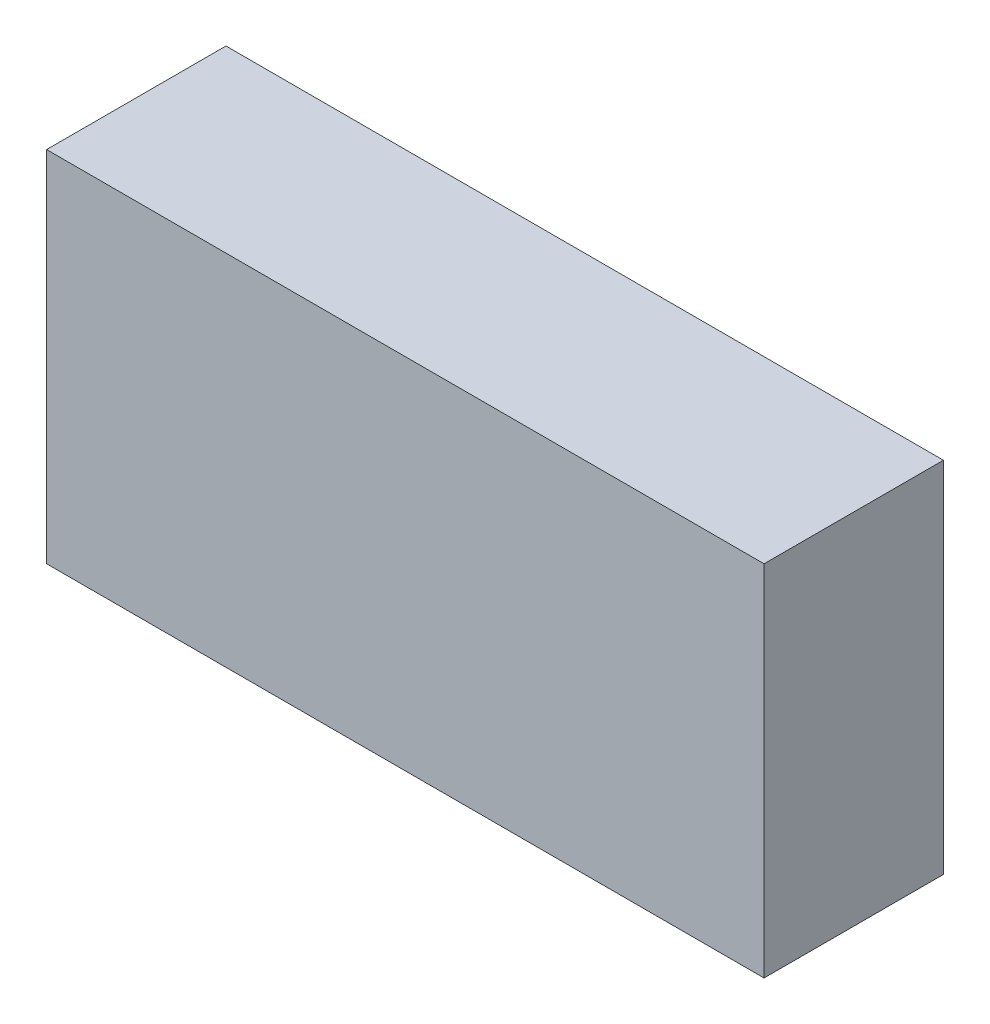
ISO-10303-21;
HEADER;
FILE_DESCRIPTION(('STEP AP214'),'2;1');
FILE_NAME('part.step','',(''),(''),'','','');
FILE_SCHEMA(('AUTOMOTIVE_DESIGN { 1 0 10303 214 1 1 1 1 }'));
ENDSEC;
DATA;
#1=APPLICATION_CONTEXT('core data for automotive mechanical design processes');
#2=APPLICATION_PROTOCOL_DEFINITION('international standard','automotive_design',2000,#1);
#3=PRODUCT_CONTEXT('',#1,'mechanical');
#4=PRODUCT('Part','Part','',(#3));
#5=PRODUCT_RELATED_PRODUCT_CATEGORY('part','',(#4));
#6=PRODUCT_DEFINITION_FORMATION('','',#4);
#7=PRODUCT_DEFINITION_CONTEXT('part definition',#1,'design');
#8=PRODUCT_DEFINITION('design','',#6,#7);
#9=PRODUCT_DEFINITION_SHAPE('','',#8);
#10=(LENGTH_UNIT() NAMED_UNIT(*) SI_UNIT(.MILLI.,.METRE.));
#11=(NAMED_UNIT(*) PLANE_ANGLE_UNIT() SI_UNIT($,.RADIAN.));
#12=(NAMED_UNIT(*) SI_UNIT($,.STERADIAN.) SOLID_ANGLE_UNIT());
#13=UNCERTAINTY_MEASURE_WITH_UNIT(LENGTH_MEASURE(1.E-05),#10,'distance_accuracy_value','');
#14=(GEOMETRIC_REPRESENTATION_CONTEXT(3) GLOBAL_UNCERTAINTY_ASSIGNED_CONTEXT((#13)) GLOBAL_UNIT_ASSIGNED_CONTEXT((#10,
#11,#12)) REPRESENTATION_CONTEXT('',''));
#15=CARTESIAN_POINT('',(0.,0.,0.));
#16=DIRECTION('',(0.,0.,1.));
#17=DIRECTION('',(1.,0.,0.));
#18=AXIS2_PLACEMENT_3D('',#15,#16,#17);
#19=CARTESIAN_POINT('',(0.80000094,-0.3999992,0.));
#20=DIRECTION('',(-1.,0.,0.));
#21=DIRECTION('',(0.,0.,1.));
#22=AXIS2_PLACEMENT_3D('',#19,#20,#21);
#23=PLANE('',#22);
#24=DIRECTION('',(0.,1.,0.));
#25=VECTOR('',#24,1.);
#26=CARTESIAN_POINT('',(0.80000094,-0.3999992,0.));
#27=LINE('',#26,#25);
#28=CARTESIAN_POINT('',(0.80000094,-0.3999992,0.));
#29=VERTEX_POINT('',#28);
#30=CARTESIAN_POINT('',(0.80000094,0.3999992,0.));
#31=VERTEX_POINT('',#30);
#32=EDGE_CURVE('E11',#29,#31,#27,.T.);
#33=ORIENTED_EDGE('',*,*,#32,.T.);
#34=DIRECTION('',(0.,0.,1.));
#35=VECTOR('',#34,1.);
#36=CARTESIAN_POINT('',(0.80000094,0.3999992,0.));
#37=LINE('',#36,#35);
#38=CARTESIAN_POINT('',(0.80000094,0.3999992,0.3999992));
#39=VERTEX_POINT('',#38);
#40=EDGE_CURVE('E27',#31,#39,#37,.T.);
#41=ORIENTED_EDGE('',*,*,#40,.T.);
#42=DIRECTION('',(0.,1.,0.));
#43=VECTOR('',#42,1.);
#44=CARTESIAN_POINT('',(0.80000094,-0.3999992,0.3999992));
#45=LINE('',#44,#43);
#46=CARTESIAN_POINT('',(0.80000094,-0.3999992,0.3999992));
#47=VERTEX_POINT('',#46);
#48=EDGE_CURVE('E50',#47,#39,#45,.T.);
#49=ORIENTED_EDGE('',*,*,#48,.F.);
#50=DIRECTION('',(0.,0.,1.));
#51=VECTOR('',#50,1.);
#52=CARTESIAN_POINT('',(0.80000094,-0.3999992,0.));
#53=LINE('',#52,#51);
#54=EDGE_CURVE('E55',#29,#47,#53,.T.);
#55=ORIENTED_EDGE('',*,*,#54,.F.);
#56=EDGE_LOOP('',(#33,#41,#49,#55));
#57=FACE_BOUND('',#56,.T.);
#58=ADVANCED_FACE('F17',(#57),#23,.F.);
#59=CARTESIAN_POINT('',(0.80000094,0.3999992,0.));
#60=DIRECTION('',(0.,-1.,0.));
#61=DIRECTION('',(0.,0.,-1.));
#62=AXIS2_PLACEMENT_3D('',#59,#60,#61);
#63=PLANE('',#62);
#64=DIRECTION('',(-1.,0.,0.));
#65=VECTOR('',#64,1.);
#66=CARTESIAN_POINT('',(0.80000094,0.3999992,0.));
#67=LINE('',#66,#65);
#68=CARTESIAN_POINT('',(-0.80000094,0.3999992,0.));
#69=VERTEX_POINT('',#68);
#70=EDGE_CURVE('E113',#31,#69,#67,.T.);
#71=ORIENTED_EDGE('',*,*,#70,.T.);
#72=DIRECTION('',(0.,0.,1.));
#73=VECTOR('',#72,1.);
#74=CARTESIAN_POINT('',(-0.80000094,0.3999992,0.));
#75=LINE('',#74,#73);
#76=CARTESIAN_POINT('',(-0.80000094,0.3999992,0.3999992));
#77=VERTEX_POINT('',#76);
#78=EDGE_CURVE('E68',#69,#77,#75,.T.);
#79=ORIENTED_EDGE('',*,*,#78,.T.);
#80=DIRECTION('',(-1.,0.,0.));
#81=VECTOR('',#80,1.);
#82=CARTESIAN_POINT('',(0.80000094,0.3999992,0.3999992));
#83=LINE('',#82,#81);
#84=EDGE_CURVE('E109',#39,#77,#83,.T.);
#85=ORIENTED_EDGE('',*,*,#84,.F.);
#86=ORIENTED_EDGE('',*,*,#40,.F.);
#87=EDGE_LOOP('',(#71,#79,#85,#86));
#88=FACE_BOUND('',#87,.T.);
#89=ADVANCED_FACE('F123',(#88),#63,.F.);
#90=CARTESIAN_POINT('',(-0.80000094,0.3999992,0.));
#91=DIRECTION('',(1.,0.,0.));
#92=DIRECTION('',(0.,1.,0.));
#93=AXIS2_PLACEMENT_3D('',#90,#91,#92);
#94=PLANE('',#93);
#95=DIRECTION('',(0.,-1.,0.));
#96=VECTOR('',#95,1.);
#97=CARTESIAN_POINT('',(-0.80000094,0.3999992,0.));
#98=LINE('',#97,#96);
#99=CARTESIAN_POINT('',(-0.80000094,-0.3999992,0.));
#100=VERTEX_POINT('',#99);
#101=EDGE_CURVE('E92',#69,#100,#98,.T.);
#102=ORIENTED_EDGE('',*,*,#101,.T.);
#103=DIRECTION('',(0.,0.,1.));
#104=VECTOR('',#103,1.);
#105=CARTESIAN_POINT('',(-0.80000094,-0.3999992,0.));
#106=LINE('',#105,#104);
#107=CARTESIAN_POINT('',(-0.80000094,-0.3999992,0.3999992));
#108=VERTEX_POINT('',#107);
#109=EDGE_CURVE('E87',#100,#108,#106,.T.);
#110=ORIENTED_EDGE('',*,*,#109,.T.);
#111=DIRECTION('',(0.,-1.,0.));
#112=VECTOR('',#111,1.);
#113=CARTESIAN_POINT('',(-0.80000094,0.3999992,0.3999992));
#114=LINE('',#113,#112);
#115=EDGE_CURVE('E79',#77,#108,#114,.T.);
#116=ORIENTED_EDGE('',*,*,#115,.F.);
#117=ORIENTED_EDGE('',*,*,#78,.F.);
#118=EDGE_LOOP('',(#102,#110,#116,#117));
#119=FACE_BOUND('',#118,.T.);
#120=ADVANCED_FACE('F95',(#119),#94,.F.);
#121=CARTESIAN_POINT('',(-0.80000094,-0.3999992,0.));
#122=DIRECTION('',(0.,1.,0.));
#123=DIRECTION('',(1.,0.,0.));
#124=AXIS2_PLACEMENT_3D('',#121,#122,#123);
#125=PLANE('',#124);
#126=DIRECTION('',(1.,0.,0.));
#127=VECTOR('',#126,1.);
#128=CARTESIAN_POINT('',(-0.80000094,-0.3999992,0.));
#129=LINE('',#128,#127);
#130=EDGE_CURVE('E20',#100,#29,#129,.T.);
#131=ORIENTED_EDGE('',*,*,#130,.T.);
#132=ORIENTED_EDGE('',*,*,#54,.T.);
#133=DIRECTION('',(1.,0.,0.));
#134=VECTOR('',#133,1.);
#135=CARTESIAN_POINT('',(-0.80000094,-0.3999992,0.3999992));
#136=LINE('',#135,#134);
#137=EDGE_CURVE('E90',#108,#47,#136,.T.);
#138=ORIENTED_EDGE('',*,*,#137,.F.);
#139=ORIENTED_EDGE('',*,*,#109,.F.);
#140=EDGE_LOOP('',(#131,#132,#138,#139));
#141=FACE_BOUND('',#140,.T.);
#142=ADVANCED_FACE('F88',(#141),#125,.F.);
#143=CARTESIAN_POINT('',(0.80000094,-0.3999992,0.));
#144=DIRECTION('',(0.,0.,-1.));
#145=DIRECTION('',(0.,-1.,0.));
#146=AXIS2_PLACEMENT_3D('',#143,#144,#145);
#147=PLANE('',#146);
#148=ORIENTED_EDGE('',*,*,#130,.F.);
#149=ORIENTED_EDGE('',*,*,#101,.F.);
#150=ORIENTED_EDGE('',*,*,#70,.F.);
#151=ORIENTED_EDGE('',*,*,#32,.F.);
#152=EDGE_LOOP('',(#148,#149,#150,#151));
#153=FACE_BOUND('',#152,.T.);
#154=ADVANCED_FACE('F100',(#153),#147,.T.);
#155=CARTESIAN_POINT('',(0.80000094,-0.3999992,0.3999992));
#156=DIRECTION('',(0.,0.,-1.));
#157=DIRECTION('',(0.,-1.,0.));
#158=AXIS2_PLACEMENT_3D('',#155,#156,#157);
#159=PLANE('',#158);
#160=ORIENTED_EDGE('',*,*,#48,.T.);
#161=ORIENTED_EDGE('',*,*,#84,.T.);
#162=ORIENTED_EDGE('',*,*,#115,.T.);
#163=ORIENTED_EDGE('',*,*,#137,.T.);
#164=EDGE_LOOP('',(#160,#161,#162,#163));
#165=FACE_BOUND('',#164,.T.);
#166=ADVANCED_FACE('F124',(#165),#159,.F.);
#167=CLOSED_SHELL('',(#58,#89,#120,#142,#154,#166));
#168=MANIFOLD_SOLID_BREP('B1',#167);
#169=ADVANCED_BREP_SHAPE_REPRESENTATION('',(#18,#168),#14);
#170=SHAPE_DEFINITION_REPRESENTATION(#9,#169);
ENDSEC;
END-ISO-10303-21;
